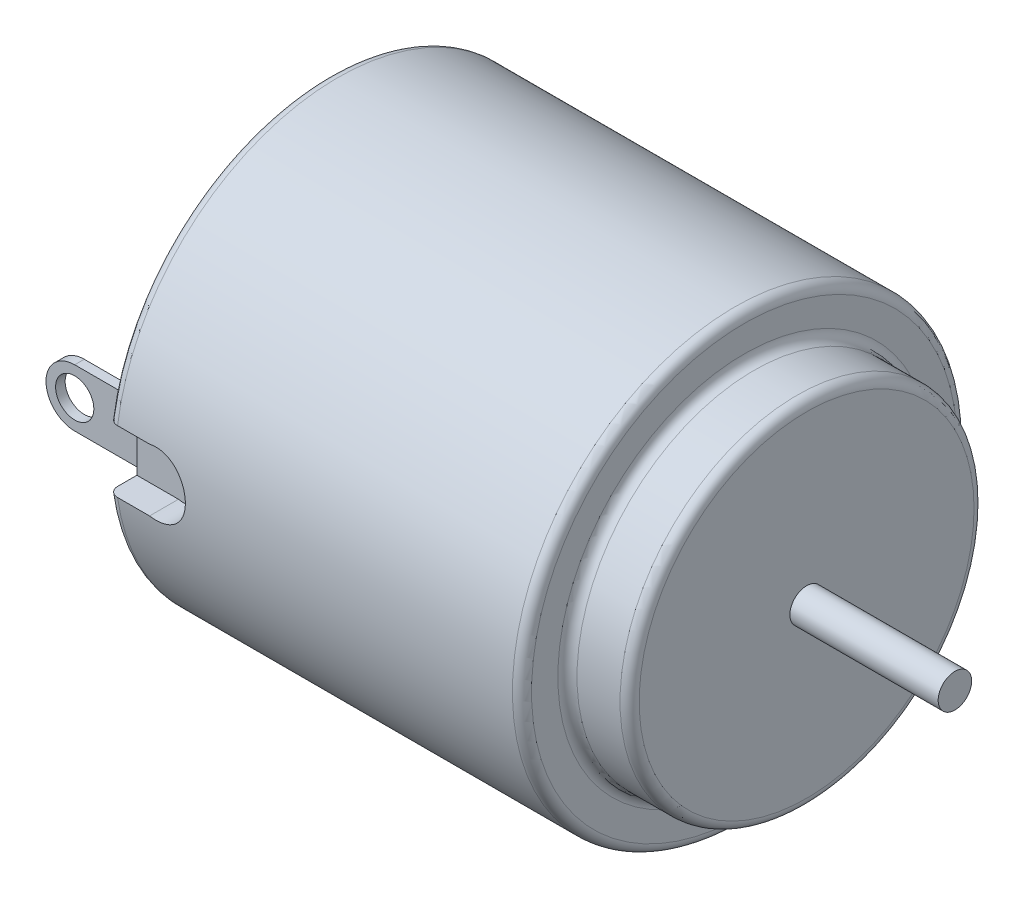
ISO-10303-21;
HEADER;
FILE_DESCRIPTION(('STEP AP214'),'2;1');
FILE_NAME('part.step','',(''),(''),'','','');
FILE_SCHEMA(('AUTOMOTIVE_DESIGN { 1 0 10303 214 1 1 1 1 }'));
ENDSEC;
DATA;
#1=APPLICATION_CONTEXT('core data for automotive mechanical design processes');
#2=APPLICATION_PROTOCOL_DEFINITION('international standard','automotive_design',2000,#1);
#3=PRODUCT_CONTEXT('',#1,'mechanical');
#4=PRODUCT('Part','Part','',(#3));
#5=PRODUCT_RELATED_PRODUCT_CATEGORY('part','',(#4));
#6=PRODUCT_DEFINITION_FORMATION('','',#4);
#7=PRODUCT_DEFINITION_CONTEXT('part definition',#1,'design');
#8=PRODUCT_DEFINITION('design','',#6,#7);
#9=PRODUCT_DEFINITION_SHAPE('','',#8);
#10=(LENGTH_UNIT() NAMED_UNIT(*) SI_UNIT(.MILLI.,.METRE.));
#11=(NAMED_UNIT(*) PLANE_ANGLE_UNIT() SI_UNIT($,.RADIAN.));
#12=(NAMED_UNIT(*) SI_UNIT($,.STERADIAN.) SOLID_ANGLE_UNIT());
#13=UNCERTAINTY_MEASURE_WITH_UNIT(LENGTH_MEASURE(1.E-05),#10,'distance_accuracy_value','');
#14=(GEOMETRIC_REPRESENTATION_CONTEXT(3) GLOBAL_UNCERTAINTY_ASSIGNED_CONTEXT((#13)) GLOBAL_UNIT_ASSIGNED_CONTEXT((#10,
#11,#12)) REPRESENTATION_CONTEXT('',''));
#15=CARTESIAN_POINT('',(0.,0.,0.));
#16=DIRECTION('',(0.,0.,1.));
#17=DIRECTION('',(1.,0.,0.));
#18=AXIS2_PLACEMENT_3D('',#15,#16,#17);
#19=CARTESIAN_POINT('',(0.,0.,0.));
#20=DIRECTION('',(1.,0.,0.));
#21=DIRECTION('',(0.,0.,-1.));
#22=AXIS2_PLACEMENT_3D('',#19,#20,#21);
#23=PLANE('',#22);
#24=DIRECTION('',(0.,0.,1.));
#25=VECTOR('',#24,1.);
#26=CARTESIAN_POINT('',(0.,-1.524,-9.906));
#27=LINE('',#26,#25);
#28=CARTESIAN_POINT('',(0.,-1.524,-9.906));
#29=VERTEX_POINT('',#28);
#30=CARTESIAN_POINT('',(0.,-1.524,-9.398));
#31=VERTEX_POINT('',#30);
#32=EDGE_CURVE('E156',#29,#31,#27,.T.);
#33=ORIENTED_EDGE('',*,*,#32,.F.);
#34=DIRECTION('',(0.,-1.,0.));
#35=VECTOR('',#34,1.);
#36=CARTESIAN_POINT('',(0.,0.,-9.906));
#37=LINE('',#36,#35);
#38=CARTESIAN_POINT('',(0.,1.524,-9.906));
#39=VERTEX_POINT('',#38);
#40=EDGE_CURVE('E151',#39,#29,#37,.T.);
#41=ORIENTED_EDGE('',*,*,#40,.F.);
#42=DIRECTION('',(0.,0.,1.));
#43=VECTOR('',#42,1.);
#44=CARTESIAN_POINT('',(0.,1.524,-9.906));
#45=LINE('',#44,#43);
#46=CARTESIAN_POINT('',(0.,1.524,-9.398));
#47=VERTEX_POINT('',#46);
#48=EDGE_CURVE('E269',#39,#47,#45,.T.);
#49=ORIENTED_EDGE('',*,*,#48,.T.);
#50=DIRECTION('',(0.,-1.,0.));
#51=VECTOR('',#50,1.);
#52=CARTESIAN_POINT('',(0.,0.,-9.398));
#53=LINE('',#52,#51);
#54=EDGE_CURVE('E262',#47,#31,#53,.T.);
#55=ORIENTED_EDGE('',*,*,#54,.T.);
#56=EDGE_LOOP('',(#33,#41,#49,#55));
#57=FACE_BOUND('',#56,.T.);
#58=DIRECTION('',(0.,1.,0.));
#59=VECTOR('',#58,1.);
#60=CARTESIAN_POINT('',(0.,-1.651,10.16));
#61=LINE('',#60,#59);
#62=CARTESIAN_POINT('',(0.,-1.651,10.16));
#63=VERTEX_POINT('',#62);
#64=CARTESIAN_POINT('',(0.,1.651,10.16));
#65=VERTEX_POINT('',#64);
#66=EDGE_CURVE('E334',#63,#65,#61,.T.);
#67=ORIENTED_EDGE('',*,*,#66,.T.);
#68=DIRECTION('',(0.,0.,-1.));
#69=VECTOR('',#68,1.);
#70=CARTESIAN_POINT('',(0.,1.651,11.811));
#71=LINE('',#70,#69);
#72=CARTESIAN_POINT('',(0.,1.651,11.181771237152));
#73=VERTEX_POINT('',#72);
#74=EDGE_CURVE('E342',#73,#65,#71,.T.);
#75=ORIENTED_EDGE('',*,*,#74,.F.);
#76=CARTESIAN_POINT('',(0.,0.,0.));
#77=DIRECTION('',(1.,0.,0.));
#78=DIRECTION('',(0.,0.,-1.));
#79=AXIS2_PLACEMENT_3D('',#76,#77,#78);
#80=CIRCLE('',#79,11.303);
#81=CARTESIAN_POINT('',(0.,-1.651,11.181771237152));
#82=VERTEX_POINT('',#81);
#83=EDGE_CURVE('E386',#73,#82,#80,.F.);
#84=ORIENTED_EDGE('',*,*,#83,.T.);
#85=DIRECTION('',(0.,0.,-1.));
#86=VECTOR('',#85,1.);
#87=CARTESIAN_POINT('',(0.,-1.651,11.811));
#88=LINE('',#87,#86);
#89=EDGE_CURVE('E338',#82,#63,#88,.T.);
#90=ORIENTED_EDGE('',*,*,#89,.T.);
#91=EDGE_LOOP('',(#67,#75,#84,#90));
#92=FACE_BOUND('',#91,.T.);
#93=DIRECTION('',(0.,1.,0.));
#94=VECTOR('',#93,1.);
#95=CARTESIAN_POINT('',(0.,0.,9.398));
#96=LINE('',#95,#94);
#97=CARTESIAN_POINT('',(0.,-1.524,9.398));
#98=VERTEX_POINT('',#97);
#99=CARTESIAN_POINT('',(0.,1.524,9.398));
#100=VERTEX_POINT('',#99);
#101=EDGE_CURVE('E291',#98,#100,#96,.T.);
#102=ORIENTED_EDGE('',*,*,#101,.T.);
#103=DIRECTION('',(0.,0.,-1.));
#104=VECTOR('',#103,1.);
#105=CARTESIAN_POINT('',(0.,1.524,9.906));
#106=LINE('',#105,#104);
#107=CARTESIAN_POINT('',(0.,1.524,9.906));
#108=VERTEX_POINT('',#107);
#109=EDGE_CURVE('E301',#108,#100,#106,.T.);
#110=ORIENTED_EDGE('',*,*,#109,.F.);
#111=DIRECTION('',(0.,1.,0.));
#112=VECTOR('',#111,1.);
#113=CARTESIAN_POINT('',(0.,0.,9.906));
#114=LINE('',#113,#112);
#115=CARTESIAN_POINT('',(0.,-1.524,9.906));
#116=VERTEX_POINT('',#115);
#117=EDGE_CURVE('E279',#116,#108,#114,.T.);
#118=ORIENTED_EDGE('',*,*,#117,.F.);
#119=DIRECTION('',(0.,0.,-1.));
#120=VECTOR('',#119,1.);
#121=CARTESIAN_POINT('',(0.,-1.524,9.906));
#122=LINE('',#121,#120);
#123=EDGE_CURVE('E304',#116,#98,#122,.T.);
#124=ORIENTED_EDGE('',*,*,#123,.T.);
#125=EDGE_LOOP('',(#102,#110,#118,#124));
#126=FACE_BOUND('',#125,.T.);
#127=ADVANCED_FACE('F129',(#57,#92,#126),#23,.F.);
#128=CARTESIAN_POINT('',(25.4,0.,0.));
#129=DIRECTION('',(-1.,0.,0.));
#130=DIRECTION('',(0.,0.,1.));
#131=AXIS2_PLACEMENT_3D('',#128,#129,#130);
#132=CYLINDRICAL_SURFACE('',#131,11.811);
#133=CARTESIAN_POINT('',(21.59,0.,0.));
#134=DIRECTION('',(1.,0.,0.));
#135=DIRECTION('',(0.,0.,-1.));
#136=AXIS2_PLACEMENT_3D('',#133,#134,#135);
#137=CIRCLE('',#136,11.811);
#138=CARTESIAN_POINT('',(21.59,0.,-11.811));
#139=VERTEX_POINT('',#138);
#140=EDGE_CURVE('E382',#139,#139,#137,.F.);
#141=ORIENTED_EDGE('',*,*,#140,.T.);
#142=EDGE_LOOP('',(#141));
#143=FACE_BOUND('',#142,.T.);
#144=CARTESIAN_POINT('',(0.508000000000002,0.,0.));
#145=DIRECTION('',(1.,0.,0.));
#146=DIRECTION('',(0.,0.,-1.));
#147=AXIS2_PLACEMENT_3D('',#144,#145,#146);
#148=CIRCLE('',#147,11.811);
#149=CARTESIAN_POINT('',(0.508000000000002,-1.651,11.6950382641529));
#150=VERTEX_POINT('',#149);
#151=CARTESIAN_POINT('',(0.508000000000002,1.651,11.6950382641529));
#152=VERTEX_POINT('',#151);
#153=EDGE_CURVE('E378',#150,#152,#148,.T.);
#154=ORIENTED_EDGE('',*,*,#153,.T.);
#155=DIRECTION('',(-1.,0.,0.));
#156=VECTOR('',#155,1.);
#157=CARTESIAN_POINT('',(25.4,1.651,11.6950382641529));
#158=LINE('',#157,#156);
#159=CARTESIAN_POINT('',(2.20719786744231,1.651,11.6950382641529));
#160=VERTEX_POINT('',#159);
#161=EDGE_CURVE('E358',#152,#160,#158,.F.);
#162=ORIENTED_EDGE('',*,*,#161,.T.);
#163=CARTESIAN_POINT('',(2.2071978674423,-1.651,11.6950382641529));
#164=CARTESIAN_POINT('',(2.25323220168763,-1.66027930333541,11.6937267908572));
#165=CARTESIAN_POINT('',(2.2996403959788,-1.66762932945033,11.692679628631));
#166=CARTESIAN_POINT('',(2.39291492234771,-1.67843098921847,11.6911345245239));
#167=CARTESIAN_POINT('',(2.43978123208574,-1.68188281201777,11.6906365559954));
#168=CARTESIAN_POINT('',(2.58046085769292,-1.68632664515457,11.6899979934907));
#169=CARTESIAN_POINT('',(2.67453247383035,-1.68144265113445,11.6907075928051));
#170=CARTESIAN_POINT('',(2.86050274767708,-1.65609776036086,11.6943241154006));
#171=CARTESIAN_POINT('',(2.95240039249117,-1.63562974455976,11.6972320429112));
#172=CARTESIAN_POINT('',(3.13143982919174,-1.57972993178092,11.7049120074309));
#173=CARTESIAN_POINT('',(3.21858217503041,-1.54429988197394,11.7096838267816));
#174=CARTESIAN_POINT('',(3.38598964886282,-1.45935021636409,11.7205737485397));
#175=CARTESIAN_POINT('',(3.46622980446983,-1.40978202691153,11.7266964754757));
#176=CARTESIAN_POINT('',(3.61731324097385,-1.2979934998323,11.7395950017273));
#177=CARTESIAN_POINT('',(3.68815458788915,-1.23577056490481,11.7463709349588));
#178=CARTESIAN_POINT('',(3.81906288230115,-1.09979126537135,11.7598842986825));
#179=CARTESIAN_POINT('',(3.8790296893754,-1.02593836429607,11.7666208677244));
#180=CARTESIAN_POINT('',(3.98572243765046,-0.869157577561149,11.7792385427371));
#181=CARTESIAN_POINT('',(4.03244925716515,-0.786230294383743,11.7851197054413));
#182=CARTESIAN_POINT('',(4.11130220394436,-0.613648280361625,11.7953642587023));
#183=CARTESIAN_POINT('',(4.14343374743509,-0.52399605951791,11.7997282121458));
#184=CARTESIAN_POINT('',(4.19216055645093,-0.340491514913961,11.806447785573));
#185=CARTESIAN_POINT('',(4.20875647509362,-0.246639367892417,11.808803489983));
#186=CARTESIAN_POINT('',(4.22583005666559,-0.0582916716207259,11.8112283002856));
#187=CARTESIAN_POINT('',(4.22644924268794,0.0361908070883966,11.8113174830898));
#188=CARTESIAN_POINT('',(4.21191083365027,0.223906550478834,11.8092505321939));
#189=CARTESIAN_POINT('',(4.19675363079832,0.317139846157033,11.807094454312));
#190=CARTESIAN_POINT('',(4.15120129684834,0.499379433111304,11.8007894052751));
#191=CARTESIAN_POINT('',(4.12086030202381,0.58839952056512,11.7966475165131));
#192=CARTESIAN_POINT('',(4.04585340887298,0.760092787453091,11.7868308634352));
#193=CARTESIAN_POINT('',(4.00118692948332,0.842765709267976,11.7811560369425));
#194=CARTESIAN_POINT('',(3.89842254988784,1.00006794420341,11.7688513637045));
#195=CARTESIAN_POINT('',(3.84023048294163,1.07463521927235,11.7622149502927));
#196=CARTESIAN_POINT('',(3.71221532865539,1.21299341022892,11.7487535380796));
#197=CARTESIAN_POINT('',(3.642391680941,1.27678380662077,11.7419285302056));
#198=CARTESIAN_POINT('',(3.49251578064211,1.39222139773089,11.728804213248));
#199=CARTESIAN_POINT('',(3.41239634212885,1.44378186166581,11.7225088519332));
#200=CARTESIAN_POINT('',(3.24453540800943,1.53271260209569,11.7112139574979));
#201=CARTESIAN_POINT('',(3.15679327991484,1.57008169968545,11.7062145320443));
#202=CARTESIAN_POINT('',(2.97653708844184,1.62940705096657,11.6981046357063));
#203=CARTESIAN_POINT('',(2.88404220956089,1.65142073298098,11.6949871325018));
#204=CARTESIAN_POINT('',(2.6966536175761,1.67957562773402,11.6909776162447));
#205=CARTESIAN_POINT('',(2.6017620542212,1.68573058803062,11.6900836756606));
#206=CARTESIAN_POINT('',(2.45670560040128,1.68290573837365,11.6904892915942));
#207=CARTESIAN_POINT('',(2.40636354916288,1.67965482390287,11.6909589678186));
#208=CARTESIAN_POINT('',(2.30627054159136,1.66866943451848,11.6925311201897));
#209=CARTESIAN_POINT('',(2.25651870154251,1.66094285344713,11.6936324821832));
#210=CARTESIAN_POINT('',(2.20719786744231,1.651,11.6950382641529));
#211=B_SPLINE_CURVE_WITH_KNOTS('',3,(#163,#164,#165,#166,#167,#168,#169,#170,#171,#172,#173,
#174,#175,#176,#177,#178,#179,#180,#181,#182,#183,#184,#185,#186,#187,#188,#189,#190,#191,#192,
#193,#194,#195,#196,#197,#198,#199,#200,#201,#202,#203,#204,#205,#206,#207,#208,#209,#210),
.UNSPECIFIED.,.F.,.F.,(4,2,2,2,2,2,2,2,2,2,2,2,2,2,2,2,2,2,2,2,2,2,2,4),(0.,0.140849711957424,
0.281692589403279,0.562841638878634,0.84411919916268,1.12536392272827,1.4075867894001,
1.68986763896615,1.97462879682328,2.25937105977831,2.54400756995542,2.82863211347813,
3.11073455761845,3.39282998873382,3.67392672732283,3.9550348690639,4.23816206626132,
4.52130290761715,4.80639536905364,5.09151150851346,5.37555552952621,5.65935323639491,
5.81051800773012,5.96141697436702),.UNSPECIFIED.);
#212=CARTESIAN_POINT('',(2.2071978674423,-1.651,11.6950382641529));
#213=VERTEX_POINT('',#212);
#214=EDGE_CURVE('E13',#213,#160,#211,.T.);
#215=ORIENTED_EDGE('',*,*,#214,.F.);
#216=DIRECTION('',(-1.,0.,0.));
#217=VECTOR('',#216,1.);
#218=CARTESIAN_POINT('',(25.4,-1.651,11.6950382641529));
#219=LINE('',#218,#217);
#220=EDGE_CURVE('E354',#150,#213,#219,.F.);
#221=ORIENTED_EDGE('',*,*,#220,.F.);
#222=EDGE_LOOP('',(#154,#162,#215,#221));
#223=FACE_BOUND('',#222,.T.);
#224=ADVANCED_FACE('F446',(#143,#223),#132,.T.);
#225=CARTESIAN_POINT('',(22.098,0.,0.));
#226=DIRECTION('',(1.,0.,0.));
#227=DIRECTION('',(0.,0.,-1.));
#228=AXIS2_PLACEMENT_3D('',#225,#226,#227);
#229=PLANE('',#228);
#230=CARTESIAN_POINT('',(22.098,0.,0.));
#231=DIRECTION('',(1.,0.,0.));
#232=DIRECTION('',(0.,0.,-1.));
#233=AXIS2_PLACEMENT_3D('',#230,#231,#232);
#234=CIRCLE('',#233,11.303);
#235=CARTESIAN_POINT('',(22.098,0.,-11.303));
#236=VERTEX_POINT('',#235);
#237=EDGE_CURVE('E374',#236,#236,#234,.T.);
#238=ORIENTED_EDGE('',*,*,#237,.T.);
#239=EDGE_LOOP('',(#238));
#240=FACE_BOUND('',#239,.T.);
#241=CARTESIAN_POINT('',(22.098,0.,0.));
#242=DIRECTION('',(1.,0.,0.));
#243=DIRECTION('',(0.,0.,-1.));
#244=AXIS2_PLACEMENT_3D('',#241,#242,#243);
#245=CIRCLE('',#244,9.906);
#246=CARTESIAN_POINT('',(22.098,0.,-9.906));
#247=VERTEX_POINT('',#246);
#248=EDGE_CURVE('E367',#247,#247,#245,.F.);
#249=ORIENTED_EDGE('',*,*,#248,.T.);
#250=EDGE_LOOP('',(#249));
#251=FACE_BOUND('',#250,.T.);
#252=ADVANCED_FACE('F442',(#240,#251),#229,.T.);
#253=CARTESIAN_POINT('',(22.098,0.,0.));
#254=DIRECTION('',(1.,0.,0.));
#255=DIRECTION('',(0.,0.,-1.));
#256=AXIS2_PLACEMENT_3D('',#253,#254,#255);
#257=CYLINDRICAL_SURFACE('',#256,9.398);
#258=CARTESIAN_POINT('',(24.892,0.,0.));
#259=DIRECTION('',(1.,0.,0.));
#260=DIRECTION('',(0.,0.,-1.));
#261=AXIS2_PLACEMENT_3D('',#258,#259,#260);
#262=CIRCLE('',#261,9.398);
#263=CARTESIAN_POINT('',(24.892,0.,-9.398));
#264=VERTEX_POINT('',#263);
#265=EDGE_CURVE('E398',#264,#264,#262,.F.);
#266=CARTESIAN_POINT('',(22.606,0.,0.));
#267=DIRECTION('',(1.,0.,0.));
#268=DIRECTION('',(0.,0.,-1.));
#269=AXIS2_PLACEMENT_3D('',#266,#267,#268);
#270=CIRCLE('',#269,9.398);
#271=CARTESIAN_POINT('',(22.606,0.,-9.398));
#272=VERTEX_POINT('',#271);
#273=EDGE_CURVE('E394',#272,#272,#270,.T.);
#274=CARTESIAN_POINT('',(24.892,0.,-9.398));
#275=CARTESIAN_POINT('',(24.8681875,0.,-9.398));
#276=CARTESIAN_POINT('',(24.844375,0.,-9.398));
#277=CARTESIAN_POINT('',(24.79675,0.,-9.398));
#278=CARTESIAN_POINT('',(24.7729375,0.,-9.398));
#279=CARTESIAN_POINT('',(24.7253125,0.,-9.398));
#280=CARTESIAN_POINT('',(24.7015,0.,-9.398));
#281=CARTESIAN_POINT('',(24.653875,0.,-9.398));
#282=CARTESIAN_POINT('',(24.6300625,0.,-9.398));
#283=CARTESIAN_POINT('',(24.5824375,0.,-9.398));
#284=CARTESIAN_POINT('',(24.558625,0.,-9.398));
#285=CARTESIAN_POINT('',(24.511,0.,-9.398));
#286=CARTESIAN_POINT('',(24.4871875,0.,-9.398));
#287=CARTESIAN_POINT('',(24.4395625,0.,-9.398));
#288=CARTESIAN_POINT('',(24.41575,0.,-9.398));
#289=CARTESIAN_POINT('',(24.368125,0.,-9.398));
#290=CARTESIAN_POINT('',(24.3443125,0.,-9.398));
#291=CARTESIAN_POINT('',(24.2966875,0.,-9.398));
#292=CARTESIAN_POINT('',(24.272875,0.,-9.398));
#293=CARTESIAN_POINT('',(24.22525,0.,-9.398));
#294=CARTESIAN_POINT('',(24.2014375,0.,-9.398));
#295=CARTESIAN_POINT('',(24.1538125,0.,-9.398));
#296=CARTESIAN_POINT('',(24.13,0.,-9.398));
#297=CARTESIAN_POINT('',(24.082375,0.,-9.398));
#298=CARTESIAN_POINT('',(24.0585625,0.,-9.398));
#299=CARTESIAN_POINT('',(24.0109375,0.,-9.398));
#300=CARTESIAN_POINT('',(23.987125,0.,-9.398));
#301=CARTESIAN_POINT('',(23.9395,0.,-9.398));
#302=CARTESIAN_POINT('',(23.9156875,0.,-9.398));
#303=CARTESIAN_POINT('',(23.8680625,0.,-9.398));
#304=CARTESIAN_POINT('',(23.84425,0.,-9.398));
#305=CARTESIAN_POINT('',(23.796625,0.,-9.398));
#306=CARTESIAN_POINT('',(23.7728125,0.,-9.398));
#307=CARTESIAN_POINT('',(23.7251875,0.,-9.398));
#308=CARTESIAN_POINT('',(23.701375,0.,-9.398));
#309=CARTESIAN_POINT('',(23.65375,0.,-9.398));
#310=CARTESIAN_POINT('',(23.6299375,0.,-9.398));
#311=CARTESIAN_POINT('',(23.5823125,0.,-9.398));
#312=CARTESIAN_POINT('',(23.5585,0.,-9.398));
#313=CARTESIAN_POINT('',(23.510875,0.,-9.398));
#314=CARTESIAN_POINT('',(23.4870625,0.,-9.398));
#315=CARTESIAN_POINT('',(23.4394375,0.,-9.398));
#316=CARTESIAN_POINT('',(23.415625,0.,-9.398));
#317=CARTESIAN_POINT('',(23.368,0.,-9.398));
#318=CARTESIAN_POINT('',(23.3441875,0.,-9.398));
#319=CARTESIAN_POINT('',(23.2965625,0.,-9.398));
#320=CARTESIAN_POINT('',(23.27275,0.,-9.398));
#321=CARTESIAN_POINT('',(23.225125,0.,-9.398));
#322=CARTESIAN_POINT('',(23.2013125,0.,-9.398));
#323=CARTESIAN_POINT('',(23.1536875,0.,-9.398));
#324=CARTESIAN_POINT('',(23.129875,0.,-9.398));
#325=CARTESIAN_POINT('',(23.08225,0.,-9.398));
#326=CARTESIAN_POINT('',(23.0584375,0.,-9.398));
#327=CARTESIAN_POINT('',(23.0108125,0.,-9.398));
#328=CARTESIAN_POINT('',(22.987,0.,-9.398));
#329=CARTESIAN_POINT('',(22.939375,0.,-9.398));
#330=CARTESIAN_POINT('',(22.9155625,0.,-9.398));
#331=CARTESIAN_POINT('',(22.8679375,0.,-9.398));
#332=CARTESIAN_POINT('',(22.844125,0.,-9.398));
#333=CARTESIAN_POINT('',(22.7965,0.,-9.398));
#334=CARTESIAN_POINT('',(22.7726875,0.,-9.398));
#335=CARTESIAN_POINT('',(22.7250625,0.,-9.398));
#336=CARTESIAN_POINT('',(22.70125,0.,-9.398));
#337=CARTESIAN_POINT('',(22.653625,0.,-9.398));
#338=CARTESIAN_POINT('',(22.6298125,0.,-9.398));
#339=CARTESIAN_POINT('',(22.606,0.,-9.398));
#340=B_SPLINE_CURVE_WITH_KNOTS('',3,(#274,#275,#276,#277,#278,#279,#280,#281,#282,#283,#284,
#285,#286,#287,#288,#289,#290,#291,#292,#293,#294,#295,#296,#297,#298,#299,#300,#301,#302,#303,
#304,#305,#306,#307,#308,#309,#310,#311,#312,#313,#314,#315,#316,#317,#318,#319,#320,#321,#322,
#323,#324,#325,#326,#327,#328,#329,#330,#331,#332,#333,#334,#335,#336,#337,#338,#339),
.UNSPECIFIED.,.F.,.F.,(4,2,2,2,2,2,2,2,2,2,2,2,2,2,2,2,2,2,2,2,2,2,2,2,2,2,2,2,2,2,2,2,4),(0.,
0.0714374999999969,0.142874999999997,0.214312499999997,0.285749999999998,0.357187499999998,
0.428624999999998,0.500062499999999,0.571499999999999,0.642937499999999,0.714374999999996,
0.785812499999997,0.857249999999997,0.928687499999997,1.000125,1.0715625,1.143,1.21443749999999,
1.285875,1.3573125,1.42875,1.5001875,1.571625,1.6430625,1.7145,1.78593749999999,
1.85737499999999,1.92881249999999,2.00024999999999,2.0716875,2.143125,2.2145625,2.286),.UNSPECIFIED.);
#341=EDGE_CURVE('BSEAM438',#264,#272,#340,.T.);
#342=ORIENTED_EDGE('',*,*,#265,.T.);
#343=ORIENTED_EDGE('',*,*,#273,.T.);
#344=ORIENTED_EDGE('',*,*,#341,.T.);
#345=ORIENTED_EDGE('',*,*,#341,.F.);
#346=EDGE_LOOP('',(#342,#344,#343,#345));
#347=FACE_BOUND('',#346,.T.);
#348=ADVANCED_FACE('F438',(#347),#257,.T.);
#349=CARTESIAN_POINT('',(25.4,0.,0.));
#350=DIRECTION('',(1.,0.,0.));
#351=DIRECTION('',(0.,0.,-1.));
#352=AXIS2_PLACEMENT_3D('',#349,#350,#351);
#353=PLANE('',#352);
#354=CARTESIAN_POINT('',(25.4,0.,0.));
#355=DIRECTION('',(1.,0.,0.));
#356=DIRECTION('',(0.,0.,-1.));
#357=AXIS2_PLACEMENT_3D('',#354,#355,#356);
#358=CIRCLE('',#357,0.889);
#359=CARTESIAN_POINT('',(25.4,0.,-0.889));
#360=VERTEX_POINT('',#359);
#361=EDGE_CURVE('E362',#360,#360,#358,.T.);
#362=ORIENTED_EDGE('',*,*,#361,.F.);
#363=EDGE_LOOP('',(#362));
#364=FACE_BOUND('',#363,.T.);
#365=CARTESIAN_POINT('',(25.4,0.,0.));
#366=DIRECTION('',(1.,0.,0.));
#367=DIRECTION('',(0.,0.,-1.));
#368=AXIS2_PLACEMENT_3D('',#365,#366,#367);
#369=CIRCLE('',#368,8.89);
#370=CARTESIAN_POINT('',(25.4,0.,-8.89));
#371=VERTEX_POINT('',#370);
#372=EDGE_CURVE('E390',#371,#371,#369,.T.);
#373=ORIENTED_EDGE('',*,*,#372,.T.);
#374=EDGE_LOOP('',(#373));
#375=FACE_BOUND('',#374,.T.);
#376=ADVANCED_FACE('F441',(#364,#375),#353,.T.);
#377=CARTESIAN_POINT('',(21.59,0.,0.));
#378=DIRECTION('',(1.,0.,0.));
#379=DIRECTION('',(0.,0.,-1.));
#380=AXIS2_PLACEMENT_3D('',#377,#378,#379);
#381=TOROIDAL_SURFACE('',#380,11.303,0.508);
#382=ORIENTED_EDGE('',*,*,#140,.F.);
#383=EDGE_LOOP('',(#382));
#384=FACE_BOUND('',#383,.T.);
#385=ORIENTED_EDGE('',*,*,#237,.F.);
#386=EDGE_LOOP('',(#385));
#387=FACE_BOUND('',#386,.T.);
#388=ADVANCED_FACE('F450',(#384,#387),#381,.T.);
#389=CARTESIAN_POINT('',(0.508000000000002,0.,0.));
#390=DIRECTION('',(1.,0.,0.));
#391=DIRECTION('',(0.,0.,-1.));
#392=AXIS2_PLACEMENT_3D('',#389,#390,#391);
#393=TOROIDAL_SURFACE('',#392,11.303,0.508);
#394=CARTESIAN_POINT('',(0.157149780500333,1.651,10.8102720606767));
#395=CARTESIAN_POINT('',(0.17761562025675,1.651,10.7905020871813));
#396=CARTESIAN_POINT('',(0.199751101969542,1.651,10.772432778921));
#397=CARTESIAN_POINT('',(0.246753407359444,1.651,10.7402426929124));
#398=CARTESIAN_POINT('',(0.271623123606474,1.651,10.7261261539116));
#399=CARTESIAN_POINT('',(0.323386517988613,1.651,10.7022817908488));
#400=CARTESIAN_POINT('',(0.350280086105718,1.651,10.6925537284269));
#401=CARTESIAN_POINT('',(0.405318579076856,1.651,10.6777869426054));
#402=CARTESIAN_POINT('',(0.433463194859423,1.651,10.672747067661));
#403=CARTESIAN_POINT('',(0.490020399262691,1.651,10.6675241713184));
#404=CARTESIAN_POINT('',(0.518430182636146,1.651,10.6673107520945));
#405=CARTESIAN_POINT('',(0.574880449484103,1.651,10.671669985217));
#406=CARTESIAN_POINT('',(0.602920928633408,1.651,10.6762426935669));
#407=CARTESIAN_POINT('',(0.657765207331316,1.651,10.6900171241092));
#408=CARTESIAN_POINT('',(0.684571922748535,1.651,10.6992072476373));
#409=CARTESIAN_POINT('',(0.736273703002043,1.651,10.7219342833381));
#410=CARTESIAN_POINT('',(0.761168735481929,1.651,10.735471269064));
#411=CARTESIAN_POINT('',(0.808488731080103,1.651,10.7665757231372));
#412=CARTESIAN_POINT('',(0.830899813509144,1.651,10.7841643007213));
#413=CARTESIAN_POINT('',(0.872489382717581,1.651,10.8228186232823));
#414=CARTESIAN_POINT('',(0.891667708698206,1.651,10.8438845411207));
#415=CARTESIAN_POINT('',(0.926462702647404,1.651,10.8891296725928));
#416=CARTESIAN_POINT('',(0.942040036441152,1.651,10.9133391335633));
#417=CARTESIAN_POINT('',(0.968959051752961,1.651,10.9640082031552));
#418=CARTESIAN_POINT('',(0.980300478399352,1.651,10.9904679470571));
#419=CARTESIAN_POINT('',(0.998546128149914,1.651,11.0451878328649));
#420=CARTESIAN_POINT('',(1.00540208293393,1.651,11.0734640752762));
#421=CARTESIAN_POINT('',(1.01430123844877,1.651,11.1307643544529));
#422=CARTESIAN_POINT('',(1.01634424262599,1.651,11.1597884217094));
#423=CARTESIAN_POINT('',(1.01555876688504,1.651,11.2179455443535));
#424=CARTESIAN_POINT('',(1.01270101180287,1.651,11.2470782101363));
#425=CARTESIAN_POINT('',(1.00213092998057,1.651,11.3044498291622));
#426=CARTESIAN_POINT('',(0.994418575933324,1.651,11.3326887773772));
#427=CARTESIAN_POINT('',(0.974353864702314,1.651,11.3874372964547));
#428=CARTESIAN_POINT('',(0.962005977726217,1.651,11.4139485046241));
#429=CARTESIAN_POINT('',(0.933003995148949,1.651,11.4645012615336));
#430=CARTESIAN_POINT('',(0.916350036349933,1.651,11.4885428886973));
#431=CARTESIAN_POINT('',(0.879329757585053,1.651,11.5332869004988));
#432=CARTESIAN_POINT('',(0.858990620855232,1.651,11.5540117711501));
#433=CARTESIAN_POINT('',(0.815090929754883,1.651,11.5917109115304));
#434=CARTESIAN_POINT('',(0.791530548538017,1.651,11.6086853827289));
#435=CARTESIAN_POINT('',(0.742107705385038,1.651,11.6382233512317));
#436=CARTESIAN_POINT('',(0.716270375186907,1.651,11.6508289005807));
#437=CARTESIAN_POINT('',(0.662833613559543,1.651,11.6714805271794));
#438=CARTESIAN_POINT('',(0.63523427418652,1.651,11.6795268424099));
#439=CARTESIAN_POINT('',(0.579310275496216,1.651,11.6907669164131));
#440=CARTESIAN_POINT('',(0.550993817338799,1.651,11.6940015057946));
#441=CARTESIAN_POINT('',(0.494221252386742,1.651,11.6956507303095));
#442=CARTESIAN_POINT('',(0.465765149697301,1.651,11.694065506296));
#443=CARTESIAN_POINT('',(0.409634589741451,1.651,11.6861384691748));
#444=CARTESIAN_POINT('',(0.381957572203319,1.651,11.6798147618007));
#445=CARTESIAN_POINT('',(0.328054429862271,1.651,11.6626209026777));
#446=CARTESIAN_POINT('',(0.301828307800506,1.651,11.6517507423396));
#447=CARTESIAN_POINT('',(0.251501149391124,1.651,11.6257549336862));
#448=CARTESIAN_POINT('',(0.227405186624559,1.651,11.6106194669864));
#449=CARTESIAN_POINT('',(0.182071772081287,1.651,11.5765463304725));
#450=CARTESIAN_POINT('',(0.160834420251655,1.651,11.5576085277731));
#451=CARTESIAN_POINT('',(0.121646377600888,1.651,11.516319726655));
#452=CARTESIAN_POINT('',(0.103721635164513,1.651,11.4939441044356));
#453=CARTESIAN_POINT('',(0.0718395590985961,1.651,11.4465257439953));
#454=CARTESIAN_POINT('',(0.0578824368239488,1.651,11.4214828637874));
#455=CARTESIAN_POINT('',(0.0341864845045781,1.651,11.3691758113639));
#456=CARTESIAN_POINT('',(0.0244907399099098,1.651,11.3418921195431));
#457=CARTESIAN_POINT('',(0.0097754708770982,1.651,11.2860925901873));
#458=CARTESIAN_POINT('',(0.00475600162271233,1.651,11.2575767381158));
#459=CARTESIAN_POINT('',(-0.000499561934307968,1.651,11.1998720672148));
#460=CARTESIAN_POINT('',(-0.000696223301378434,1.651,11.1706796528951));
#461=CARTESIAN_POINT('',(0.0037983801751184,1.651,11.1126651485455));
#462=CARTESIAN_POINT('',(0.00849097484805221,1.651,11.0838431614272));
#463=CARTESIAN_POINT('',(0.0226624104638944,1.651,11.0272957004189));
#464=CARTESIAN_POINT('',(0.0321578947471549,1.651,10.9995744034586));
#465=CARTESIAN_POINT('',(0.0556822106171804,1.651,10.9461533655466));
#466=CARTESIAN_POINT('',(0.0697056000682646,1.651,10.9204512436046));
#467=CARTESIAN_POINT('',(0.096078403559835,1.651,10.8805810270321));
#468=CARTESIAN_POINT('',(0.107210754184686,1.651,10.8655935518874));
#469=CARTESIAN_POINT('',(0.131039586647108,1.651,10.8369178853637));
#470=CARTESIAN_POINT('',(0.143736065333271,1.651,10.8232296913669));
#471=CARTESIAN_POINT('',(0.157149780500333,1.651,10.8102720606767));
#472=B_SPLINE_CURVE_WITH_KNOTS('',3,(#394,#395,#396,#397,#398,#399,#400,#401,#402,#403,#404,
#405,#406,#407,#408,#409,#410,#411,#412,#413,#414,#415,#416,#417,#418,#419,#420,#421,#422,#423,
#424,#425,#426,#427,#428,#429,#430,#431,#432,#433,#434,#435,#436,#437,#438,#439,#440,#441,#442,
#443,#444,#445,#446,#447,#448,#449,#450,#451,#452,#453,#454,#455,#456,#457,#458,#459,#460,#461,
#462,#463,#464,#465,#466,#467,#468,#469,#470,#471),.UNSPECIFIED.,.T.,.F.,(4,2,2,2,2,2,2,2,2,2,2,
2,2,2,2,2,2,2,2,2,2,2,2,2,2,2,2,2,2,2,2,2,2,2,2,2,2,2,4),(0.,0.0852986705197035,
0.17068846369433,0.256073618368536,0.341437794613166,0.42626418222866,0.511091562427381,
0.595706918844002,0.680323707111726,0.765391749673856,0.85046402231115,0.936425740899111,
1.02239263091264,1.10927002819685,1.19615097336093,1.28355271994839,1.37095495817498,
1.45827312695293,1.5455885220089,1.63228428852802,1.71897539666373,1.8048072613682,
1.89063464544877,1.97572948947387,2.06082184673294,2.14559071377004,2.23035974095395,
2.31532551614129,2.40029426125925,2.48590271855109,2.57151573534624,2.65797549086906,
2.74443626667263,2.83160374187496,2.91879493196055,3.00629035504823,3.09368100552197,
3.14958754976082,3.20549398136091),.UNSPECIFIED.);
#473=EDGE_CURVE('E144',#152,#73,#472,.T.);
#474=ORIENTED_EDGE('',*,*,#473,.F.);
#475=ORIENTED_EDGE('',*,*,#153,.F.);
#476=CARTESIAN_POINT('',(0.157149780500333,-1.651,10.8102720606767));
#477=CARTESIAN_POINT('',(0.17761562025675,-1.651,10.7905020871813));
#478=CARTESIAN_POINT('',(0.199751101969542,-1.651,10.772432778921));
#479=CARTESIAN_POINT('',(0.246753407359444,-1.651,10.7402426929124));
#480=CARTESIAN_POINT('',(0.271623123606474,-1.651,10.7261261539116));
#481=CARTESIAN_POINT('',(0.323386517988613,-1.651,10.7022817908488));
#482=CARTESIAN_POINT('',(0.350280086105718,-1.651,10.6925537284269));
#483=CARTESIAN_POINT('',(0.405318579076856,-1.651,10.6777869426054));
#484=CARTESIAN_POINT('',(0.433463194859423,-1.651,10.672747067661));
#485=CARTESIAN_POINT('',(0.490020399262691,-1.651,10.6675241713184));
#486=CARTESIAN_POINT('',(0.518430182636146,-1.651,10.6673107520945));
#487=CARTESIAN_POINT('',(0.574880449484103,-1.651,10.671669985217));
#488=CARTESIAN_POINT('',(0.602920928633408,-1.651,10.6762426935669));
#489=CARTESIAN_POINT('',(0.657765207331316,-1.651,10.6900171241092));
#490=CARTESIAN_POINT('',(0.684571922748535,-1.651,10.6992072476373));
#491=CARTESIAN_POINT('',(0.736273703002043,-1.651,10.7219342833381));
#492=CARTESIAN_POINT('',(0.761168735481929,-1.651,10.735471269064));
#493=CARTESIAN_POINT('',(0.808488731080103,-1.651,10.7665757231372));
#494=CARTESIAN_POINT('',(0.830899813509144,-1.651,10.7841643007213));
#495=CARTESIAN_POINT('',(0.872489382717581,-1.651,10.8228186232823));
#496=CARTESIAN_POINT('',(0.891667708698206,-1.651,10.8438845411207));
#497=CARTESIAN_POINT('',(0.926462702647404,-1.651,10.8891296725928));
#498=CARTESIAN_POINT('',(0.942040036441152,-1.651,10.9133391335633));
#499=CARTESIAN_POINT('',(0.968959051752961,-1.651,10.9640082031552));
#500=CARTESIAN_POINT('',(0.980300478399352,-1.651,10.9904679470571));
#501=CARTESIAN_POINT('',(0.998546128149914,-1.651,11.0451878328649));
#502=CARTESIAN_POINT('',(1.00540208293393,-1.651,11.0734640752762));
#503=CARTESIAN_POINT('',(1.01430123844877,-1.651,11.1307643544529));
#504=CARTESIAN_POINT('',(1.01634424262599,-1.651,11.1597884217094));
#505=CARTESIAN_POINT('',(1.01555876688504,-1.651,11.2179455443535));
#506=CARTESIAN_POINT('',(1.01270101180287,-1.651,11.2470782101363));
#507=CARTESIAN_POINT('',(1.00213092998057,-1.651,11.3044498291622));
#508=CARTESIAN_POINT('',(0.994418575933324,-1.651,11.3326887773772));
#509=CARTESIAN_POINT('',(0.974353864702314,-1.651,11.3874372964547));
#510=CARTESIAN_POINT('',(0.962005977726217,-1.651,11.4139485046241));
#511=CARTESIAN_POINT('',(0.933003995148949,-1.651,11.4645012615336));
#512=CARTESIAN_POINT('',(0.916350036349933,-1.651,11.4885428886973));
#513=CARTESIAN_POINT('',(0.879329757585053,-1.651,11.5332869004988));
#514=CARTESIAN_POINT('',(0.858990620855232,-1.651,11.5540117711501));
#515=CARTESIAN_POINT('',(0.815090929754883,-1.651,11.5917109115304));
#516=CARTESIAN_POINT('',(0.791530548538017,-1.651,11.6086853827289));
#517=CARTESIAN_POINT('',(0.742107705385038,-1.651,11.6382233512317));
#518=CARTESIAN_POINT('',(0.716270375186907,-1.651,11.6508289005807));
#519=CARTESIAN_POINT('',(0.662833613559543,-1.651,11.6714805271794));
#520=CARTESIAN_POINT('',(0.63523427418652,-1.651,11.6795268424099));
#521=CARTESIAN_POINT('',(0.579310275496216,-1.651,11.6907669164131));
#522=CARTESIAN_POINT('',(0.550993817338799,-1.651,11.6940015057946));
#523=CARTESIAN_POINT('',(0.494221252386742,-1.651,11.6956507303095));
#524=CARTESIAN_POINT('',(0.465765149697301,-1.651,11.694065506296));
#525=CARTESIAN_POINT('',(0.409634589741451,-1.651,11.6861384691748));
#526=CARTESIAN_POINT('',(0.381957572203319,-1.651,11.6798147618007));
#527=CARTESIAN_POINT('',(0.328054429862271,-1.651,11.6626209026777));
#528=CARTESIAN_POINT('',(0.301828307800506,-1.651,11.6517507423396));
#529=CARTESIAN_POINT('',(0.251501149391124,-1.651,11.6257549336862));
#530=CARTESIAN_POINT('',(0.227405186624559,-1.651,11.6106194669864));
#531=CARTESIAN_POINT('',(0.182071772081287,-1.651,11.5765463304725));
#532=CARTESIAN_POINT('',(0.160834420251655,-1.651,11.5576085277731));
#533=CARTESIAN_POINT('',(0.121646377600888,-1.651,11.516319726655));
#534=CARTESIAN_POINT('',(0.103721635164513,-1.651,11.4939441044356));
#535=CARTESIAN_POINT('',(0.0718395590985961,-1.651,11.4465257439953));
#536=CARTESIAN_POINT('',(0.0578824368239488,-1.651,11.4214828637874));
#537=CARTESIAN_POINT('',(0.0341864845045781,-1.651,11.3691758113639));
#538=CARTESIAN_POINT('',(0.0244907399099098,-1.651,11.3418921195431));
#539=CARTESIAN_POINT('',(0.0097754708770982,-1.651,11.2860925901873));
#540=CARTESIAN_POINT('',(0.00475600162271233,-1.651,11.2575767381158));
#541=CARTESIAN_POINT('',(-0.000499561934307968,-1.651,11.1998720672148));
#542=CARTESIAN_POINT('',(-0.000696223301378434,-1.651,11.1706796528951));
#543=CARTESIAN_POINT('',(0.0037983801751184,-1.651,11.1126651485455));
#544=CARTESIAN_POINT('',(0.00849097484805221,-1.651,11.0838431614272));
#545=CARTESIAN_POINT('',(0.0226624104638944,-1.651,11.0272957004189));
#546=CARTESIAN_POINT('',(0.0321578947471549,-1.651,10.9995744034586));
#547=CARTESIAN_POINT('',(0.0556822106171804,-1.651,10.9461533655466));
#548=CARTESIAN_POINT('',(0.0697056000682646,-1.651,10.9204512436046));
#549=CARTESIAN_POINT('',(0.096078403559835,-1.651,10.8805810270321));
#550=CARTESIAN_POINT('',(0.107210754184686,-1.651,10.8655935518874));
#551=CARTESIAN_POINT('',(0.131039586647108,-1.651,10.8369178853637));
#552=CARTESIAN_POINT('',(0.143736065333271,-1.651,10.8232296913669));
#553=CARTESIAN_POINT('',(0.157149780500333,-1.651,10.8102720606767));
#554=B_SPLINE_CURVE_WITH_KNOTS('',3,(#476,#477,#478,#479,#480,#481,#482,#483,#484,#485,#486,
#487,#488,#489,#490,#491,#492,#493,#494,#495,#496,#497,#498,#499,#500,#501,#502,#503,#504,#505,
#506,#507,#508,#509,#510,#511,#512,#513,#514,#515,#516,#517,#518,#519,#520,#521,#522,#523,#524,
#525,#526,#527,#528,#529,#530,#531,#532,#533,#534,#535,#536,#537,#538,#539,#540,#541,#542,#543,
#544,#545,#546,#547,#548,#549,#550,#551,#552,#553),.UNSPECIFIED.,.T.,.F.,(4,2,2,2,2,2,2,2,2,2,2,
2,2,2,2,2,2,2,2,2,2,2,2,2,2,2,2,2,2,2,2,2,2,2,2,2,2,2,4),(0.,0.0852986705197035,
0.17068846369433,0.256073618368536,0.341437794613166,0.42626418222866,0.511091562427381,
0.595706918844002,0.680323707111726,0.765391749673856,0.85046402231115,0.936425740899111,
1.02239263091264,1.10927002819685,1.19615097336093,1.28355271994839,1.37095495817498,
1.45827312695293,1.5455885220089,1.63228428852802,1.71897539666373,1.8048072613682,
1.89063464544877,1.97572948947387,2.06082184673294,2.14559071377004,2.23035974095395,
2.31532551614129,2.40029426125925,2.48590271855109,2.57151573534624,2.65797549086906,
2.74443626667263,2.83160374187496,2.91879493196055,3.00629035504823,3.09368100552197,
3.14958754976082,3.20549398136091),.UNSPECIFIED.);
#555=EDGE_CURVE('E402',#150,#82,#554,.T.);
#556=ORIENTED_EDGE('',*,*,#555,.T.);
#557=ORIENTED_EDGE('',*,*,#83,.F.);
#558=EDGE_LOOP('',(#474,#475,#556,#557));
#559=FACE_BOUND('',#558,.T.);
#560=ADVANCED_FACE('F414',(#559),#393,.T.);
#561=CARTESIAN_POINT('',(24.892,0.,0.));
#562=DIRECTION('',(1.,0.,0.));
#563=DIRECTION('',(0.,0.,-1.));
#564=AXIS2_PLACEMENT_3D('',#561,#562,#563);
#565=TOROIDAL_SURFACE('',#564,8.89,0.508);
#566=ORIENTED_EDGE('',*,*,#265,.F.);
#567=EDGE_LOOP('',(#566));
#568=FACE_BOUND('',#567,.T.);
#569=ORIENTED_EDGE('',*,*,#372,.F.);
#570=EDGE_LOOP('',(#569));
#571=FACE_BOUND('',#570,.T.);
#572=ADVANCED_FACE('F461',(#568,#571),#565,.T.);
#573=CARTESIAN_POINT('',(22.606,0.,0.));
#574=DIRECTION('',(1.,0.,0.));
#575=DIRECTION('',(0.,0.,-1.));
#576=AXIS2_PLACEMENT_3D('',#573,#574,#575);
#577=TOROIDAL_SURFACE('',#576,9.906,0.508);
#578=ORIENTED_EDGE('',*,*,#248,.F.);
#579=EDGE_LOOP('',(#578));
#580=FACE_BOUND('',#579,.T.);
#581=ORIENTED_EDGE('',*,*,#273,.F.);
#582=EDGE_LOOP('',(#581));
#583=FACE_BOUND('',#582,.T.);
#584=ADVANCED_FACE('F131',(#580,#583),#577,.F.);
#585=CARTESIAN_POINT('',(33.274,0.,0.));
#586=DIRECTION('',(-1.,0.,0.));
#587=DIRECTION('',(0.,0.,1.));
#588=AXIS2_PLACEMENT_3D('',#585,#586,#587);
#589=CYLINDRICAL_SURFACE('',#588,0.889);
#590=CARTESIAN_POINT('',(33.274,0.,0.));
#591=DIRECTION('',(1.,0.,0.));
#592=DIRECTION('',(0.,0.,-1.));
#593=AXIS2_PLACEMENT_3D('',#590,#591,#592);
#594=CIRCLE('',#593,0.889);
#595=CARTESIAN_POINT('',(33.274,0.,-0.889));
#596=VERTEX_POINT('',#595);
#597=EDGE_CURVE('E363',#596,#596,#594,.T.);
#598=ORIENTED_EDGE('',*,*,#597,.F.);
#599=EDGE_LOOP('',(#598));
#600=FACE_BOUND('',#599,.T.);
#601=ORIENTED_EDGE('',*,*,#361,.T.);
#602=EDGE_LOOP('',(#601));
#603=FACE_BOUND('',#602,.T.);
#604=ADVANCED_FACE('F433',(#600,#603),#589,.T.);
#605=CARTESIAN_POINT('',(33.274,0.,0.));
#606=DIRECTION('',(1.,0.,0.));
#607=DIRECTION('',(0.,0.,-1.));
#608=AXIS2_PLACEMENT_3D('',#605,#606,#607);
#609=PLANE('',#608);
#610=ORIENTED_EDGE('',*,*,#597,.T.);
#611=EDGE_LOOP('',(#610));
#612=FACE_BOUND('',#611,.T.);
#613=ADVANCED_FACE('F429',(#612),#609,.T.);
#614=CARTESIAN_POINT('',(2.54,0.,11.811));
#615=DIRECTION('',(0.,0.,-1.));
#616=DIRECTION('',(-1.,0.,0.));
#617=AXIS2_PLACEMENT_3D('',#614,#615,#616);
#618=CYLINDRICAL_SURFACE('',#617,1.68420849642642);
#619=DIRECTION('',(0.,0.,-1.));
#620=VECTOR('',#619,1.);
#621=CARTESIAN_POINT('',(2.2071978674423,-1.651,11.811));
#622=LINE('',#621,#620);
#623=CARTESIAN_POINT('',(2.2071978674423,-1.651,10.16));
#624=VERTEX_POINT('',#623);
#625=EDGE_CURVE('E351',#213,#624,#622,.T.);
#626=ORIENTED_EDGE('',*,*,#625,.F.);
#627=ORIENTED_EDGE('',*,*,#214,.T.);
#628=DIRECTION('',(0.,0.,-1.));
#629=VECTOR('',#628,1.);
#630=CARTESIAN_POINT('',(2.20719786744231,1.651,11.811));
#631=LINE('',#630,#629);
#632=CARTESIAN_POINT('',(2.20719786744231,1.651,10.16));
#633=VERTEX_POINT('',#632);
#634=EDGE_CURVE('E345',#160,#633,#631,.T.);
#635=ORIENTED_EDGE('',*,*,#634,.T.);
#636=CARTESIAN_POINT('',(2.54,0.,10.16));
#637=DIRECTION('',(0.,0.,1.));
#638=DIRECTION('',(1.,0.,0.));
#639=AXIS2_PLACEMENT_3D('',#636,#637,#638);
#640=CIRCLE('',#639,1.68420849642642);
#641=EDGE_CURVE('E311',#624,#633,#640,.T.);
#642=ORIENTED_EDGE('',*,*,#641,.F.);
#643=EDGE_LOOP('',(#626,#627,#635,#642));
#644=FACE_BOUND('',#643,.T.);
#645=ADVANCED_FACE('F425',(#644),#618,.F.);
#646=CARTESIAN_POINT('',(0.,1.651,11.811));
#647=DIRECTION('',(0.,1.,0.));
#648=DIRECTION('',(-1.,0.,0.));
#649=AXIS2_PLACEMENT_3D('',#646,#647,#648);
#650=PLANE('',#649);
#651=ORIENTED_EDGE('',*,*,#473,.T.);
#652=ORIENTED_EDGE('',*,*,#74,.T.);
#653=DIRECTION('',(1.,0.,0.));
#654=VECTOR('',#653,1.);
#655=CARTESIAN_POINT('',(0.,1.651,10.16));
#656=LINE('',#655,#654);
#657=EDGE_CURVE('E330',#65,#633,#656,.T.);
#658=ORIENTED_EDGE('',*,*,#657,.T.);
#659=ORIENTED_EDGE('',*,*,#634,.F.);
#660=ORIENTED_EDGE('',*,*,#161,.F.);
#661=EDGE_LOOP('',(#651,#652,#658,#659,#660));
#662=FACE_BOUND('',#661,.T.);
#663=ADVANCED_FACE('F421',(#662),#650,.F.);
#664=CARTESIAN_POINT('',(0.,-1.651,11.811));
#665=DIRECTION('',(0.,1.,0.));
#666=DIRECTION('',(-1.,0.,0.));
#667=AXIS2_PLACEMENT_3D('',#664,#665,#666);
#668=PLANE('',#667);
#669=ORIENTED_EDGE('',*,*,#220,.T.);
#670=ORIENTED_EDGE('',*,*,#625,.T.);
#671=DIRECTION('',(1.,0.,0.));
#672=VECTOR('',#671,1.);
#673=CARTESIAN_POINT('',(0.,-1.651,10.16));
#674=LINE('',#673,#672);
#675=EDGE_CURVE('E326',#63,#624,#674,.T.);
#676=ORIENTED_EDGE('',*,*,#675,.F.);
#677=ORIENTED_EDGE('',*,*,#89,.F.);
#678=ORIENTED_EDGE('',*,*,#555,.F.);
#679=EDGE_LOOP('',(#669,#670,#676,#677,#678));
#680=FACE_BOUND('',#679,.T.);
#681=ADVANCED_FACE('F417',(#680),#668,.T.);
#682=CARTESIAN_POINT('',(0.,0.,10.16));
#683=DIRECTION('',(0.,0.,1.));
#684=DIRECTION('',(1.,0.,0.));
#685=AXIS2_PLACEMENT_3D('',#682,#683,#684);
#686=PLANE('',#685);
#687=ORIENTED_EDGE('',*,*,#657,.F.);
#688=ORIENTED_EDGE('',*,*,#66,.F.);
#689=ORIENTED_EDGE('',*,*,#675,.T.);
#690=ORIENTED_EDGE('',*,*,#641,.T.);
#691=EDGE_LOOP('',(#687,#688,#689,#690));
#692=FACE_BOUND('',#691,.T.);
#693=ADVANCED_FACE('F420',(#692),#686,.T.);
#694=CARTESIAN_POINT('',(0.,-1.524,9.906));
#695=DIRECTION('',(0.,1.,0.));
#696=DIRECTION('',(0.,0.,1.));
#697=AXIS2_PLACEMENT_3D('',#694,#695,#696);
#698=PLANE('',#697);
#699=DIRECTION('',(1.,0.,0.));
#700=VECTOR('',#699,1.);
#701=CARTESIAN_POINT('',(0.,-1.524,9.398));
#702=LINE('',#701,#700);
#703=CARTESIAN_POINT('',(-3.556,-1.524,9.398));
#704=VERTEX_POINT('',#703);
#705=EDGE_CURVE('E288',#704,#98,#702,.T.);
#706=ORIENTED_EDGE('',*,*,#705,.T.);
#707=ORIENTED_EDGE('',*,*,#123,.F.);
#708=DIRECTION('',(1.,0.,0.));
#709=VECTOR('',#708,1.);
#710=CARTESIAN_POINT('',(0.,-1.524,9.906));
#711=LINE('',#710,#709);
#712=CARTESIAN_POINT('',(-3.556,-1.524,9.906));
#713=VERTEX_POINT('',#712);
#714=EDGE_CURVE('E275',#713,#116,#711,.T.);
#715=ORIENTED_EDGE('',*,*,#714,.F.);
#716=DIRECTION('',(0.,0.,-1.));
#717=VECTOR('',#716,1.);
#718=CARTESIAN_POINT('',(-3.556,-1.524,9.906));
#719=LINE('',#718,#717);
#720=EDGE_CURVE('E308',#713,#704,#719,.T.);
#721=ORIENTED_EDGE('',*,*,#720,.T.);
#722=EDGE_LOOP('',(#706,#707,#715,#721));
#723=FACE_BOUND('',#722,.T.);
#724=ADVANCED_FACE('F522',(#723),#698,.F.);
#725=CARTESIAN_POINT('',(0.,1.524,9.906));
#726=DIRECTION('',(0.,1.,0.));
#727=DIRECTION('',(-1.,0.,0.));
#728=AXIS2_PLACEMENT_3D('',#725,#726,#727);
#729=PLANE('',#728);
#730=DIRECTION('',(1.,0.,0.));
#731=VECTOR('',#730,1.);
#732=CARTESIAN_POINT('',(0.,1.524,9.398));
#733=LINE('',#732,#731);
#734=CARTESIAN_POINT('',(-3.556,1.524,9.398));
#735=VERTEX_POINT('',#734);
#736=EDGE_CURVE('E280',#735,#100,#733,.T.);
#737=ORIENTED_EDGE('',*,*,#736,.F.);
#738=DIRECTION('',(0.,0.,-1.));
#739=VECTOR('',#738,1.);
#740=CARTESIAN_POINT('',(-3.556,1.524,9.906));
#741=LINE('',#740,#739);
#742=CARTESIAN_POINT('',(-3.556,1.524,9.906));
#743=VERTEX_POINT('',#742);
#744=EDGE_CURVE('E287',#743,#735,#741,.T.);
#745=ORIENTED_EDGE('',*,*,#744,.F.);
#746=DIRECTION('',(1.,0.,0.));
#747=VECTOR('',#746,1.);
#748=CARTESIAN_POINT('',(0.,1.524,9.906));
#749=LINE('',#748,#747);
#750=EDGE_CURVE('E283',#743,#108,#749,.T.);
#751=ORIENTED_EDGE('',*,*,#750,.T.);
#752=ORIENTED_EDGE('',*,*,#109,.T.);
#753=EDGE_LOOP('',(#737,#745,#751,#752));
#754=FACE_BOUND('',#753,.T.);
#755=ADVANCED_FACE('F532',(#754),#729,.T.);
#756=CARTESIAN_POINT('',(0.,0.,9.398));
#757=DIRECTION('',(0.,0.,1.));
#758=DIRECTION('',(1.,0.,0.));
#759=AXIS2_PLACEMENT_3D('',#756,#757,#758);
#760=PLANE('',#759);
#761=ORIENTED_EDGE('',*,*,#705,.F.);
#762=CARTESIAN_POINT('',(-3.556,0.,9.398));
#763=DIRECTION('',(0.,0.,1.));
#764=DIRECTION('',(1.,0.,0.));
#765=AXIS2_PLACEMENT_3D('',#762,#763,#764);
#766=CIRCLE('',#765,1.524);
#767=EDGE_CURVE('E316',#735,#704,#766,.T.);
#768=ORIENTED_EDGE('',*,*,#767,.F.);
#769=ORIENTED_EDGE('',*,*,#736,.T.);
#770=ORIENTED_EDGE('',*,*,#101,.F.);
#771=EDGE_LOOP('',(#761,#768,#769,#770));
#772=FACE_BOUND('',#771,.T.);
#773=CARTESIAN_POINT('',(-3.556,0.,9.398));
#774=DIRECTION('',(0.,0.,1.));
#775=DIRECTION('',(1.,0.,0.));
#776=AXIS2_PLACEMENT_3D('',#773,#774,#775);
#777=CIRCLE('',#776,1.016);
#778=CARTESIAN_POINT('',(-2.54,0.,9.398));
#779=VERTEX_POINT('',#778);
#780=EDGE_CURVE('E274',#779,#779,#777,.T.);
#781=ORIENTED_EDGE('',*,*,#780,.T.);
#782=EDGE_LOOP('',(#781));
#783=FACE_BOUND('',#782,.T.);
#784=ADVANCED_FACE('F542',(#772,#783),#760,.F.);
#785=CARTESIAN_POINT('',(0.,0.,9.906));
#786=DIRECTION('',(0.,0.,1.));
#787=DIRECTION('',(1.,0.,0.));
#788=AXIS2_PLACEMENT_3D('',#785,#786,#787);
#789=PLANE('',#788);
#790=ORIENTED_EDGE('',*,*,#750,.F.);
#791=CARTESIAN_POINT('',(-3.556,0.,9.906));
#792=DIRECTION('',(0.,0.,1.));
#793=DIRECTION('',(1.,0.,0.));
#794=AXIS2_PLACEMENT_3D('',#791,#792,#793);
#795=CIRCLE('',#794,1.524);
#796=EDGE_CURVE('E292',#743,#713,#795,.T.);
#797=ORIENTED_EDGE('',*,*,#796,.T.);
#798=ORIENTED_EDGE('',*,*,#714,.T.);
#799=ORIENTED_EDGE('',*,*,#117,.T.);
#800=EDGE_LOOP('',(#790,#797,#798,#799));
#801=FACE_BOUND('',#800,.T.);
#802=CARTESIAN_POINT('',(-3.556,0.,9.906));
#803=DIRECTION('',(0.,0.,1.));
#804=DIRECTION('',(1.,0.,0.));
#805=AXIS2_PLACEMENT_3D('',#802,#803,#804);
#806=CIRCLE('',#805,1.016);
#807=CARTESIAN_POINT('',(-2.54,0.,9.906));
#808=VERTEX_POINT('',#807);
#809=EDGE_CURVE('E312',#808,#808,#806,.T.);
#810=ORIENTED_EDGE('',*,*,#809,.F.);
#811=EDGE_LOOP('',(#810));
#812=FACE_BOUND('',#811,.T.);
#813=ADVANCED_FACE('F553',(#801,#812),#789,.T.);
#814=CARTESIAN_POINT('',(-3.556,0.,9.906));
#815=DIRECTION('',(0.,0.,-1.));
#816=DIRECTION('',(-1.,0.,0.));
#817=AXIS2_PLACEMENT_3D('',#814,#815,#816);
#818=CYLINDRICAL_SURFACE('',#817,1.016);
#819=ORIENTED_EDGE('',*,*,#809,.T.);
#820=EDGE_LOOP('',(#819));
#821=FACE_BOUND('',#820,.T.);
#822=ORIENTED_EDGE('',*,*,#780,.F.);
#823=EDGE_LOOP('',(#822));
#824=FACE_BOUND('',#823,.T.);
#825=ADVANCED_FACE('F564',(#821,#824),#818,.F.);
#826=CARTESIAN_POINT('',(-3.556,0.,9.906));
#827=DIRECTION('',(0.,0.,-1.));
#828=DIRECTION('',(-1.,0.,0.));
#829=AXIS2_PLACEMENT_3D('',#826,#827,#828);
#830=CYLINDRICAL_SURFACE('',#829,1.524);
#831=ORIENTED_EDGE('',*,*,#767,.T.);
#832=ORIENTED_EDGE('',*,*,#720,.F.);
#833=ORIENTED_EDGE('',*,*,#796,.F.);
#834=ORIENTED_EDGE('',*,*,#744,.T.);
#835=EDGE_LOOP('',(#831,#832,#833,#834));
#836=FACE_BOUND('',#835,.T.);
#837=ADVANCED_FACE('F567',(#836),#830,.T.);
#838=CARTESIAN_POINT('',(0.,1.524,-9.906));
#839=DIRECTION('',(0.,-1.,0.));
#840=DIRECTION('',(0.,0.,-1.));
#841=AXIS2_PLACEMENT_3D('',#838,#839,#840);
#842=PLANE('',#841);
#843=DIRECTION('',(1.,0.,0.));
#844=VECTOR('',#843,1.);
#845=CARTESIAN_POINT('',(0.,1.524,-9.398));
#846=LINE('',#845,#844);
#847=CARTESIAN_POINT('',(-3.556,1.524,-9.398));
#848=VERTEX_POINT('',#847);
#849=EDGE_CURVE('E239',#848,#47,#846,.T.);
#850=ORIENTED_EDGE('',*,*,#849,.T.);
#851=ORIENTED_EDGE('',*,*,#48,.F.);
#852=DIRECTION('',(1.,0.,0.));
#853=VECTOR('',#852,1.);
#854=CARTESIAN_POINT('',(0.,1.524,-9.906));
#855=LINE('',#854,#853);
#856=CARTESIAN_POINT('',(-3.556,1.524,-9.906));
#857=VERTEX_POINT('',#856);
#858=EDGE_CURVE('E255',#857,#39,#855,.T.);
#859=ORIENTED_EDGE('',*,*,#858,.F.);
#860=DIRECTION('',(0.,0.,1.));
#861=VECTOR('',#860,1.);
#862=CARTESIAN_POINT('',(-3.556,1.524,-9.906));
#863=LINE('',#862,#861);
#864=EDGE_CURVE('E234',#857,#848,#863,.T.);
#865=ORIENTED_EDGE('',*,*,#864,.T.);
#866=EDGE_LOOP('',(#850,#851,#859,#865));
#867=FACE_BOUND('',#866,.T.);
#868=ADVANCED_FACE('F577',(#867),#842,.F.);
#869=CARTESIAN_POINT('',(0.,-1.524,-9.906));
#870=DIRECTION('',(0.,-1.,0.));
#871=DIRECTION('',(1.,0.,0.));
#872=AXIS2_PLACEMENT_3D('',#869,#870,#871);
#873=PLANE('',#872);
#874=DIRECTION('',(1.,0.,0.));
#875=VECTOR('',#874,1.);
#876=CARTESIAN_POINT('',(0.,-1.524,-9.398));
#877=LINE('',#876,#875);
#878=CARTESIAN_POINT('',(-3.556,-1.524,-9.398));
#879=VERTEX_POINT('',#878);
#880=EDGE_CURVE('E247',#879,#31,#877,.T.);
#881=ORIENTED_EDGE('',*,*,#880,.F.);
#882=DIRECTION('',(0.,0.,1.));
#883=VECTOR('',#882,1.);
#884=CARTESIAN_POINT('',(-3.556,-1.524,-9.906));
#885=LINE('',#884,#883);
#886=CARTESIAN_POINT('',(-3.556,-1.524,-9.906));
#887=VERTEX_POINT('',#886);
#888=EDGE_CURVE('E231',#887,#879,#885,.T.);
#889=ORIENTED_EDGE('',*,*,#888,.F.);
#890=DIRECTION('',(1.,0.,0.));
#891=VECTOR('',#890,1.);
#892=CARTESIAN_POINT('',(0.,-1.524,-9.906));
#893=LINE('',#892,#891);
#894=EDGE_CURVE('E245',#887,#29,#893,.T.);
#895=ORIENTED_EDGE('',*,*,#894,.T.);
#896=ORIENTED_EDGE('',*,*,#32,.T.);
#897=EDGE_LOOP('',(#881,#889,#895,#896));
#898=FACE_BOUND('',#897,.T.);
#899=ADVANCED_FACE('F244',(#898),#873,.T.);
#900=CARTESIAN_POINT('',(0.,0.,-9.906));
#901=DIRECTION('',(0.,0.,-1.));
#902=DIRECTION('',(1.,0.,0.));
#903=AXIS2_PLACEMENT_3D('',#900,#901,#902);
#904=PLANE('',#903);
#905=ORIENTED_EDGE('',*,*,#894,.F.);
#906=CARTESIAN_POINT('',(-3.556,0.,-9.906));
#907=DIRECTION('',(0.,0.,-1.));
#908=DIRECTION('',(1.,0.,0.));
#909=AXIS2_PLACEMENT_3D('',#906,#907,#908);
#910=CIRCLE('',#909,1.524);
#911=EDGE_CURVE('E228',#887,#857,#910,.T.);
#912=ORIENTED_EDGE('',*,*,#911,.T.);
#913=ORIENTED_EDGE('',*,*,#858,.T.);
#914=ORIENTED_EDGE('',*,*,#40,.T.);
#915=EDGE_LOOP('',(#905,#912,#913,#914));
#916=FACE_BOUND('',#915,.T.);
#917=CARTESIAN_POINT('',(-3.556,0.,-9.906));
#918=DIRECTION('',(0.,0.,-1.));
#919=DIRECTION('',(1.,0.,0.));
#920=AXIS2_PLACEMENT_3D('',#917,#918,#919);
#921=CIRCLE('',#920,1.016);
#922=CARTESIAN_POINT('',(-2.54,0.,-9.906));
#923=VERTEX_POINT('',#922);
#924=EDGE_CURVE('E652',#923,#923,#921,.T.);
#925=ORIENTED_EDGE('',*,*,#924,.F.);
#926=EDGE_LOOP('',(#925));
#927=FACE_BOUND('',#926,.T.);
#928=ADVANCED_FACE('F250',(#916,#927),#904,.T.);
#929=CARTESIAN_POINT('',(0.,0.,-9.398));
#930=DIRECTION('',(0.,0.,-1.));
#931=DIRECTION('',(1.,0.,0.));
#932=AXIS2_PLACEMENT_3D('',#929,#930,#931);
#933=PLANE('',#932);
#934=ORIENTED_EDGE('',*,*,#849,.F.);
#935=CARTESIAN_POINT('',(-3.556,0.,-9.398));
#936=DIRECTION('',(0.,0.,-1.));
#937=DIRECTION('',(1.,0.,0.));
#938=AXIS2_PLACEMENT_3D('',#935,#936,#937);
#939=CIRCLE('',#938,1.524);
#940=EDGE_CURVE('E240',#879,#848,#939,.T.);
#941=ORIENTED_EDGE('',*,*,#940,.F.);
#942=ORIENTED_EDGE('',*,*,#880,.T.);
#943=ORIENTED_EDGE('',*,*,#54,.F.);
#944=EDGE_LOOP('',(#934,#941,#942,#943));
#945=FACE_BOUND('',#944,.T.);
#946=CARTESIAN_POINT('',(-3.556,0.,-9.398));
#947=DIRECTION('',(0.,0.,-1.));
#948=DIRECTION('',(1.,0.,0.));
#949=AXIS2_PLACEMENT_3D('',#946,#947,#948);
#950=CIRCLE('',#949,1.016);
#951=CARTESIAN_POINT('',(-2.54,0.,-9.398));
#952=VERTEX_POINT('',#951);
#953=EDGE_CURVE('E655',#952,#952,#950,.T.);
#954=ORIENTED_EDGE('',*,*,#953,.T.);
#955=EDGE_LOOP('',(#954));
#956=FACE_BOUND('',#955,.T.);
#957=ADVANCED_FACE('F617',(#945,#956),#933,.F.);
#958=CARTESIAN_POINT('',(-3.556,0.,-9.906));
#959=DIRECTION('',(0.,0.,1.));
#960=DIRECTION('',(1.,0.,0.));
#961=AXIS2_PLACEMENT_3D('',#958,#959,#960);
#962=CYLINDRICAL_SURFACE('',#961,1.524);
#963=ORIENTED_EDGE('',*,*,#940,.T.);
#964=ORIENTED_EDGE('',*,*,#864,.F.);
#965=ORIENTED_EDGE('',*,*,#911,.F.);
#966=ORIENTED_EDGE('',*,*,#888,.T.);
#967=EDGE_LOOP('',(#963,#964,#965,#966));
#968=FACE_BOUND('',#967,.T.);
#969=ADVANCED_FACE('F230',(#968),#962,.T.);
#970=CARTESIAN_POINT('',(-3.556,0.,-9.906));
#971=DIRECTION('',(0.,0.,1.));
#972=DIRECTION('',(1.,0.,0.));
#973=AXIS2_PLACEMENT_3D('',#970,#971,#972);
#974=CYLINDRICAL_SURFACE('',#973,1.016);
#975=ORIENTED_EDGE('',*,*,#924,.T.);
#976=EDGE_LOOP('',(#975));
#977=FACE_BOUND('',#976,.T.);
#978=ORIENTED_EDGE('',*,*,#953,.F.);
#979=EDGE_LOOP('',(#978));
#980=FACE_BOUND('',#979,.T.);
#981=ADVANCED_FACE('F636',(#977,#980),#974,.F.);
#982=CLOSED_SHELL('',(#127,#224,#252,#348,#376,#388,#560,#572,#584,#604,#613,#645,#663,#681,
#693,#724,#755,#784,#813,#825,#837,#868,#899,#928,#957,#969,#981));
#983=MANIFOLD_SOLID_BREP('B2',#982);
#984=ADVANCED_BREP_SHAPE_REPRESENTATION('',(#18,#983),#14);
#985=SHAPE_DEFINITION_REPRESENTATION(#9,#984);
ENDSEC;
END-ISO-10303-21;
